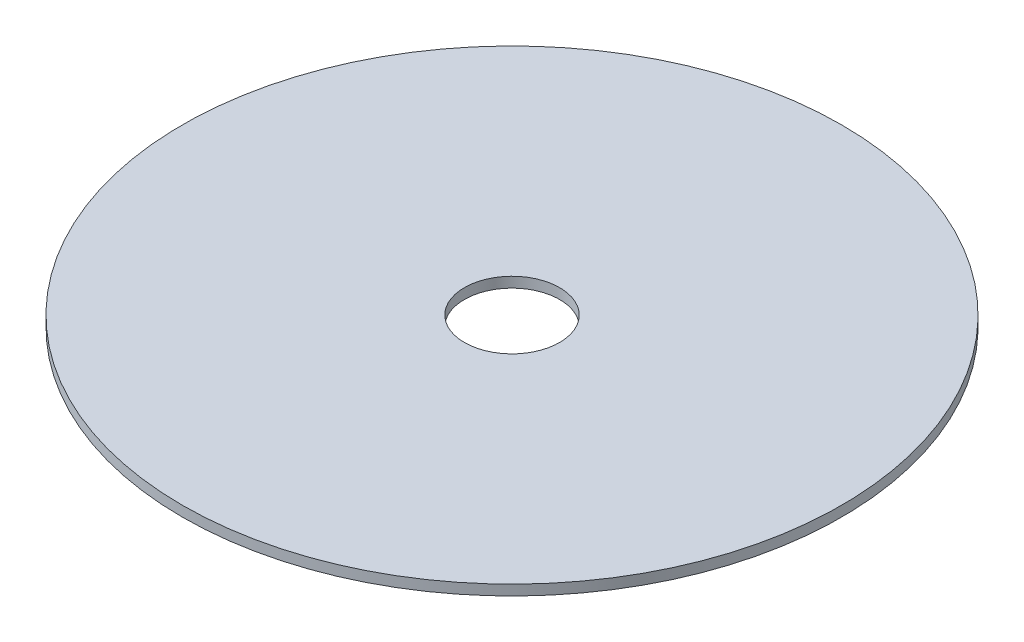
ISO-10303-21;
HEADER;
FILE_DESCRIPTION(('STEP AP214'),'2;1');
FILE_NAME('part.step','',(''),(''),'','','');
FILE_SCHEMA(('AUTOMOTIVE_DESIGN { 1 0 10303 214 1 1 1 1 }'));
ENDSEC;
DATA;
#1=APPLICATION_CONTEXT('core data for automotive mechanical design processes');
#2=APPLICATION_PROTOCOL_DEFINITION('international standard','automotive_design',2000,#1);
#3=PRODUCT_CONTEXT('',#1,'mechanical');
#4=PRODUCT('Part','Part','',(#3));
#5=PRODUCT_RELATED_PRODUCT_CATEGORY('part','',(#4));
#6=PRODUCT_DEFINITION_FORMATION('','',#4);
#7=PRODUCT_DEFINITION_CONTEXT('part definition',#1,'design');
#8=PRODUCT_DEFINITION('design','',#6,#7);
#9=PRODUCT_DEFINITION_SHAPE('','',#8);
#10=(LENGTH_UNIT() NAMED_UNIT(*) SI_UNIT(.MILLI.,.METRE.));
#11=(NAMED_UNIT(*) PLANE_ANGLE_UNIT() SI_UNIT($,.RADIAN.));
#12=(NAMED_UNIT(*) SI_UNIT($,.STERADIAN.) SOLID_ANGLE_UNIT());
#13=UNCERTAINTY_MEASURE_WITH_UNIT(LENGTH_MEASURE(1.E-05),#10,'distance_accuracy_value','');
#14=(GEOMETRIC_REPRESENTATION_CONTEXT(3) GLOBAL_UNCERTAINTY_ASSIGNED_CONTEXT((#13)) GLOBAL_UNIT_ASSIGNED_CONTEXT((#10,
#11,#12)) REPRESENTATION_CONTEXT('',''));
#15=CARTESIAN_POINT('',(0.,0.,0.));
#16=DIRECTION('',(0.,0.,1.));
#17=DIRECTION('',(1.,0.,0.));
#18=AXIS2_PLACEMENT_3D('',#15,#16,#17);
#19=CARTESIAN_POINT('',(0.,-1.5875,0.));
#20=DIRECTION('',(0.,1.,0.));
#21=DIRECTION('',(0.,0.,1.));
#22=AXIS2_PLACEMENT_3D('',#19,#20,#21);
#23=CYLINDRICAL_SURFACE('',#22,50.8);
#24=CARTESIAN_POINT('',(0.,-1.5875,0.));
#25=DIRECTION('',(0.,1.,0.));
#26=DIRECTION('',(0.,0.,1.));
#27=AXIS2_PLACEMENT_3D('',#24,#25,#26);
#28=CIRCLE('',#27,50.8);
#29=CARTESIAN_POINT('',(0.,-1.5875,50.8));
#30=VERTEX_POINT('',#29);
#31=EDGE_CURVE('E10',#30,#30,#28,.T.);
#32=ORIENTED_EDGE('',*,*,#31,.T.);
#33=EDGE_LOOP('',(#32));
#34=FACE_BOUND('',#33,.T.);
#35=CARTESIAN_POINT('',(0.,0.,0.));
#36=DIRECTION('',(0.,1.,0.));
#37=DIRECTION('',(0.,0.,1.));
#38=AXIS2_PLACEMENT_3D('',#35,#36,#37);
#39=CIRCLE('',#38,50.8);
#40=CARTESIAN_POINT('',(0.,0.,50.8));
#41=VERTEX_POINT('',#40);
#42=EDGE_CURVE('E40',#41,#41,#39,.T.);
#43=ORIENTED_EDGE('',*,*,#42,.F.);
#44=EDGE_LOOP('',(#43));
#45=FACE_BOUND('',#44,.T.);
#46=ADVANCED_FACE('F37',(#34,#45),#23,.T.);
#47=CARTESIAN_POINT('',(0.,-1.5875,0.));
#48=DIRECTION('',(0.,1.,0.));
#49=DIRECTION('',(0.,0.,1.));
#50=AXIS2_PLACEMENT_3D('',#47,#48,#49);
#51=PLANE('',#50);
#52=CARTESIAN_POINT('',(0.,-1.5875,0.));
#53=DIRECTION('',(0.,1.,0.));
#54=DIRECTION('',(0.,0.,1.));
#55=AXIS2_PLACEMENT_3D('',#52,#53,#54);
#56=CIRCLE('',#55,7.33234841870825);
#57=CARTESIAN_POINT('',(0.,-1.5875,7.33234841870825));
#58=VERTEX_POINT('',#57);
#59=EDGE_CURVE('E47',#58,#58,#56,.T.);
#60=ORIENTED_EDGE('',*,*,#59,.T.);
#61=EDGE_LOOP('',(#60));
#62=FACE_BOUND('',#61,.T.);
#63=ORIENTED_EDGE('',*,*,#31,.F.);
#64=EDGE_LOOP('',(#63));
#65=FACE_BOUND('',#64,.T.);
#66=ADVANCED_FACE('F55',(#62,#65),#51,.F.);
#67=CARTESIAN_POINT('',(0.,0.,0.));
#68=DIRECTION('',(0.,1.,0.));
#69=DIRECTION('',(0.,0.,1.));
#70=AXIS2_PLACEMENT_3D('',#67,#68,#69);
#71=PLANE('',#70);
#72=CARTESIAN_POINT('',(0.,0.,0.));
#73=DIRECTION('',(0.,1.,0.));
#74=DIRECTION('',(0.,0.,1.));
#75=AXIS2_PLACEMENT_3D('',#72,#73,#74);
#76=CIRCLE('',#75,7.33234841870825);
#77=CARTESIAN_POINT('',(0.,0.,7.33234841870825));
#78=VERTEX_POINT('',#77);
#79=EDGE_CURVE('E49',#78,#78,#76,.T.);
#80=ORIENTED_EDGE('',*,*,#79,.F.);
#81=EDGE_LOOP('',(#80));
#82=FACE_BOUND('',#81,.T.);
#83=ORIENTED_EDGE('',*,*,#42,.T.);
#84=EDGE_LOOP('',(#83));
#85=FACE_BOUND('',#84,.T.);
#86=ADVANCED_FACE('F61',(#82,#85),#71,.T.);
#87=CARTESIAN_POINT('',(0.,-1.5875,0.));
#88=DIRECTION('',(0.,1.,0.));
#89=DIRECTION('',(0.,0.,1.));
#90=AXIS2_PLACEMENT_3D('',#87,#88,#89);
#91=CYLINDRICAL_SURFACE('',#90,7.33234841870825);
#92=ORIENTED_EDGE('',*,*,#59,.F.);
#93=EDGE_LOOP('',(#92));
#94=FACE_BOUND('',#93,.T.);
#95=ORIENTED_EDGE('',*,*,#79,.T.);
#96=EDGE_LOOP('',(#95));
#97=FACE_BOUND('',#96,.T.);
#98=ADVANCED_FACE('F58',(#94,#97),#91,.F.);
#99=CLOSED_SHELL('',(#46,#66,#86,#98));
#100=MANIFOLD_SOLID_BREP('B2',#99);
#101=ADVANCED_BREP_SHAPE_REPRESENTATION('',(#18,#100),#14);
#102=SHAPE_DEFINITION_REPRESENTATION(#9,#101);
ENDSEC;
END-ISO-10303-21;
